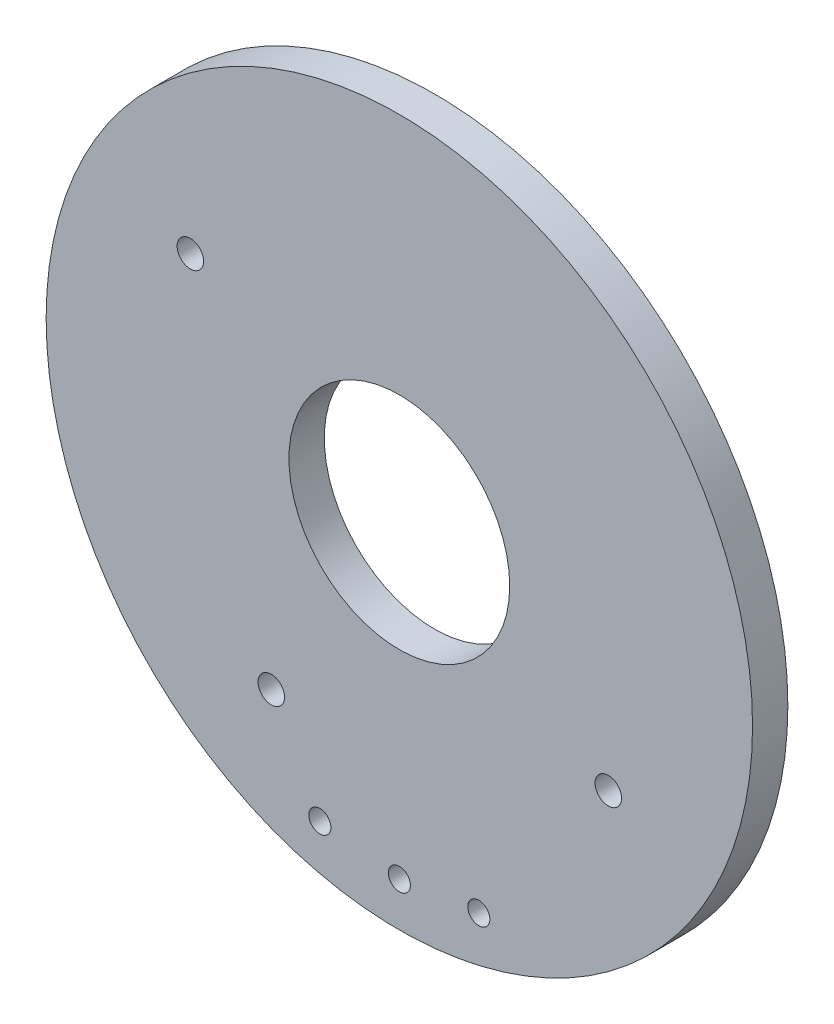
ISO-10303-21;
HEADER;
FILE_DESCRIPTION(('STEP AP214'),'2;1');
FILE_NAME('part.step','',(''),(''),'','','');
FILE_SCHEMA(('AUTOMOTIVE_DESIGN { 1 0 10303 214 1 1 1 1 }'));
ENDSEC;
DATA;
#1=APPLICATION_CONTEXT('core data for automotive mechanical design processes');
#2=APPLICATION_PROTOCOL_DEFINITION('international standard','automotive_design',2000,#1);
#3=PRODUCT_CONTEXT('',#1,'mechanical');
#4=PRODUCT('Part','Part','',(#3));
#5=PRODUCT_RELATED_PRODUCT_CATEGORY('part','',(#4));
#6=PRODUCT_DEFINITION_FORMATION('','',#4);
#7=PRODUCT_DEFINITION_CONTEXT('part definition',#1,'design');
#8=PRODUCT_DEFINITION('design','',#6,#7);
#9=PRODUCT_DEFINITION_SHAPE('','',#8);
#10=(LENGTH_UNIT() NAMED_UNIT(*) SI_UNIT(.MILLI.,.METRE.));
#11=(NAMED_UNIT(*) PLANE_ANGLE_UNIT() SI_UNIT($,.RADIAN.));
#12=(NAMED_UNIT(*) SI_UNIT($,.STERADIAN.) SOLID_ANGLE_UNIT());
#13=UNCERTAINTY_MEASURE_WITH_UNIT(LENGTH_MEASURE(1.E-05),#10,'distance_accuracy_value','');
#14=(GEOMETRIC_REPRESENTATION_CONTEXT(3) GLOBAL_UNCERTAINTY_ASSIGNED_CONTEXT((#13)) GLOBAL_UNIT_ASSIGNED_CONTEXT((#10,
#11,#12)) REPRESENTATION_CONTEXT('',''));
#15=CARTESIAN_POINT('',(0.,0.,0.));
#16=DIRECTION('',(0.,0.,1.));
#17=DIRECTION('',(1.,0.,0.));
#18=AXIS2_PLACEMENT_3D('',#15,#16,#17);
#19=CARTESIAN_POINT('',(0.,0.,0.8));
#20=DIRECTION('',(0.,0.,1.));
#21=DIRECTION('',(1.,0.,0.));
#22=AXIS2_PLACEMENT_3D('',#19,#20,#21);
#23=PLANE('',#22);
#24=CARTESIAN_POINT('',(-4.73299587998975,2.90000000000016,0.8));
#25=DIRECTION('',(0.,0.,1.));
#26=DIRECTION('',(1.,0.,0.));
#27=AXIS2_PLACEMENT_3D('',#24,#25,#26);
#28=CIRCLE('',#27,0.299999999999909);
#29=CARTESIAN_POINT('',(-4.43299587998985,2.90000000000016,0.8));
#30=VERTEX_POINT('',#29);
#31=EDGE_CURVE('E81',#30,#30,#28,.T.);
#32=ORIENTED_EDGE('',*,*,#31,.F.);
#33=EDGE_LOOP('',(#32));
#34=FACE_BOUND('',#33,.T.);
#35=CARTESIAN_POINT('',(-2.90000000000016,-4.73299587998975,0.8));
#36=DIRECTION('',(0.,0.,1.));
#37=DIRECTION('',(1.,0.,0.));
#38=AXIS2_PLACEMENT_3D('',#35,#36,#37);
#39=CIRCLE('',#38,0.300000000000102);
#40=CARTESIAN_POINT('',(-2.60000000000005,-4.73299587998975,0.8));
#41=VERTEX_POINT('',#40);
#42=EDGE_CURVE('E84',#41,#41,#39,.T.);
#43=ORIENTED_EDGE('',*,*,#42,.F.);
#44=EDGE_LOOP('',(#43));
#45=FACE_BOUND('',#44,.T.);
#46=CARTESIAN_POINT('',(4.73299587998975,-2.90000000000016,0.8));
#47=DIRECTION('',(0.,0.,1.));
#48=DIRECTION('',(1.,0.,0.));
#49=AXIS2_PLACEMENT_3D('',#46,#47,#48);
#50=CIRCLE('',#49,0.3);
#51=CARTESIAN_POINT('',(5.03299587998975,-2.90000000000016,0.8));
#52=VERTEX_POINT('',#51);
#53=EDGE_CURVE('E87',#52,#52,#50,.T.);
#54=ORIENTED_EDGE('',*,*,#53,.F.);
#55=EDGE_LOOP('',(#54));
#56=FACE_BOUND('',#55,.T.);
#57=CARTESIAN_POINT('',(1.8,-6.76461381011511,0.8));
#58=DIRECTION('',(0.,0.,1.));
#59=DIRECTION('',(1.,0.,0.));
#60=AXIS2_PLACEMENT_3D('',#57,#58,#59);
#61=CIRCLE('',#60,0.25);
#62=CARTESIAN_POINT('',(2.05,-6.76461381011511,0.8));
#63=VERTEX_POINT('',#62);
#64=EDGE_CURVE('E90',#63,#63,#61,.T.);
#65=ORIENTED_EDGE('',*,*,#64,.F.);
#66=EDGE_LOOP('',(#65));
#67=FACE_BOUND('',#66,.T.);
#68=CARTESIAN_POINT('',(-1.8,-6.76461381011511,0.8));
#69=DIRECTION('',(0.,0.,1.));
#70=DIRECTION('',(1.,0.,0.));
#71=AXIS2_PLACEMENT_3D('',#68,#69,#70);
#72=CIRCLE('',#71,0.25);
#73=CARTESIAN_POINT('',(-1.55,-6.76461381011511,0.8));
#74=VERTEX_POINT('',#73);
#75=EDGE_CURVE('E80',#74,#74,#72,.T.);
#76=ORIENTED_EDGE('',*,*,#75,.F.);
#77=EDGE_LOOP('',(#76));
#78=FACE_BOUND('',#77,.T.);
#79=CARTESIAN_POINT('',(0.,-7.,0.8));
#80=DIRECTION('',(0.,0.,1.));
#81=DIRECTION('',(1.,0.,0.));
#82=AXIS2_PLACEMENT_3D('',#79,#80,#81);
#83=CIRCLE('',#82,0.25);
#84=CARTESIAN_POINT('',(0.25,-7.,0.8));
#85=VERTEX_POINT('',#84);
#86=EDGE_CURVE('E56',#85,#85,#83,.T.);
#87=ORIENTED_EDGE('',*,*,#86,.F.);
#88=EDGE_LOOP('',(#87));
#89=FACE_BOUND('',#88,.T.);
#90=CARTESIAN_POINT('',(0.,0.,0.8));
#91=DIRECTION('',(0.,0.,1.));
#92=DIRECTION('',(1.,0.,0.));
#93=AXIS2_PLACEMENT_3D('',#90,#91,#92);
#94=CIRCLE('',#93,8.);
#95=CARTESIAN_POINT('',(8.,0.,0.8));
#96=VERTEX_POINT('',#95);
#97=EDGE_CURVE('E10',#96,#96,#94,.T.);
#98=ORIENTED_EDGE('',*,*,#97,.T.);
#99=EDGE_LOOP('',(#98));
#100=FACE_BOUND('',#99,.T.);
#101=CARTESIAN_POINT('',(0.,0.,0.8));
#102=DIRECTION('',(0.,0.,1.));
#103=DIRECTION('',(1.,0.,0.));
#104=AXIS2_PLACEMENT_3D('',#101,#102,#103);
#105=CIRCLE('',#104,2.5);
#106=CARTESIAN_POINT('',(2.5,0.,0.8));
#107=VERTEX_POINT('',#106);
#108=EDGE_CURVE('E46',#107,#107,#105,.T.);
#109=ORIENTED_EDGE('',*,*,#108,.F.);
#110=EDGE_LOOP('',(#109));
#111=FACE_BOUND('',#110,.T.);
#112=ADVANCED_FACE('F33',(#34,#45,#56,#67,#78,#89,#100,#111),#23,.T.);
#113=CARTESIAN_POINT('',(0.,0.,0.));
#114=DIRECTION('',(0.,0.,1.));
#115=DIRECTION('',(1.,0.,0.));
#116=AXIS2_PLACEMENT_3D('',#113,#114,#115);
#117=PLANE('',#116);
#118=CARTESIAN_POINT('',(-4.73299587998975,2.90000000000016,0.));
#119=DIRECTION('',(0.,0.,1.));
#120=DIRECTION('',(1.,0.,0.));
#121=AXIS2_PLACEMENT_3D('',#118,#119,#120);
#122=CIRCLE('',#121,0.299999999999909);
#123=CARTESIAN_POINT('',(-4.43299587998985,2.90000000000016,0.));
#124=VERTEX_POINT('',#123);
#125=EDGE_CURVE('E37',#124,#124,#122,.T.);
#126=ORIENTED_EDGE('',*,*,#125,.T.);
#127=EDGE_LOOP('',(#126));
#128=FACE_BOUND('',#127,.T.);
#129=CARTESIAN_POINT('',(-2.90000000000016,-4.73299587998975,0.));
#130=DIRECTION('',(0.,0.,1.));
#131=DIRECTION('',(1.,0.,0.));
#132=AXIS2_PLACEMENT_3D('',#129,#130,#131);
#133=CIRCLE('',#132,0.300000000000102);
#134=CARTESIAN_POINT('',(-2.60000000000005,-4.73299587998975,0.));
#135=VERTEX_POINT('',#134);
#136=EDGE_CURVE('E64',#135,#135,#133,.T.);
#137=ORIENTED_EDGE('',*,*,#136,.T.);
#138=EDGE_LOOP('',(#137));
#139=FACE_BOUND('',#138,.T.);
#140=CARTESIAN_POINT('',(4.73299587998975,-2.90000000000016,0.));
#141=DIRECTION('',(0.,0.,1.));
#142=DIRECTION('',(1.,0.,0.));
#143=AXIS2_PLACEMENT_3D('',#140,#141,#142);
#144=CIRCLE('',#143,0.3);
#145=CARTESIAN_POINT('',(5.03299587998975,-2.90000000000016,0.));
#146=VERTEX_POINT('',#145);
#147=EDGE_CURVE('E62',#146,#146,#144,.T.);
#148=ORIENTED_EDGE('',*,*,#147,.T.);
#149=EDGE_LOOP('',(#148));
#150=FACE_BOUND('',#149,.T.);
#151=CARTESIAN_POINT('',(1.8,-6.76461381011511,0.));
#152=DIRECTION('',(0.,0.,1.));
#153=DIRECTION('',(1.,0.,0.));
#154=AXIS2_PLACEMENT_3D('',#151,#152,#153);
#155=CIRCLE('',#154,0.25);
#156=CARTESIAN_POINT('',(2.05,-6.76461381011511,0.));
#157=VERTEX_POINT('',#156);
#158=EDGE_CURVE('E59',#157,#157,#155,.T.);
#159=ORIENTED_EDGE('',*,*,#158,.T.);
#160=EDGE_LOOP('',(#159));
#161=FACE_BOUND('',#160,.T.);
#162=CARTESIAN_POINT('',(-1.8,-6.76461381011511,0.));
#163=DIRECTION('',(0.,0.,1.));
#164=DIRECTION('',(1.,0.,0.));
#165=AXIS2_PLACEMENT_3D('',#162,#163,#164);
#166=CIRCLE('',#165,0.25);
#167=CARTESIAN_POINT('',(-1.55,-6.76461381011511,0.));
#168=VERTEX_POINT('',#167);
#169=EDGE_CURVE('E55',#168,#168,#166,.T.);
#170=ORIENTED_EDGE('',*,*,#169,.T.);
#171=EDGE_LOOP('',(#170));
#172=FACE_BOUND('',#171,.T.);
#173=CARTESIAN_POINT('',(0.,-7.,0.));
#174=DIRECTION('',(0.,0.,1.));
#175=DIRECTION('',(1.,0.,0.));
#176=AXIS2_PLACEMENT_3D('',#173,#174,#175);
#177=CIRCLE('',#176,0.25);
#178=CARTESIAN_POINT('',(0.25,-7.,0.));
#179=VERTEX_POINT('',#178);
#180=EDGE_CURVE('E52',#179,#179,#177,.T.);
#181=ORIENTED_EDGE('',*,*,#180,.T.);
#182=EDGE_LOOP('',(#181));
#183=FACE_BOUND('',#182,.T.);
#184=CARTESIAN_POINT('',(0.,0.,0.));
#185=DIRECTION('',(0.,0.,1.));
#186=DIRECTION('',(1.,0.,0.));
#187=AXIS2_PLACEMENT_3D('',#184,#185,#186);
#188=CIRCLE('',#187,8.);
#189=CARTESIAN_POINT('',(8.,0.,0.));
#190=VERTEX_POINT('',#189);
#191=EDGE_CURVE('E41',#190,#190,#188,.T.);
#192=ORIENTED_EDGE('',*,*,#191,.F.);
#193=EDGE_LOOP('',(#192));
#194=FACE_BOUND('',#193,.T.);
#195=CARTESIAN_POINT('',(0.,0.,0.));
#196=DIRECTION('',(0.,0.,1.));
#197=DIRECTION('',(1.,0.,0.));
#198=AXIS2_PLACEMENT_3D('',#195,#196,#197);
#199=CIRCLE('',#198,2.5);
#200=CARTESIAN_POINT('',(2.5,0.,0.));
#201=VERTEX_POINT('',#200);
#202=EDGE_CURVE('E49',#201,#201,#199,.T.);
#203=ORIENTED_EDGE('',*,*,#202,.T.);
#204=EDGE_LOOP('',(#203));
#205=FACE_BOUND('',#204,.T.);
#206=ADVANCED_FACE('F101',(#128,#139,#150,#161,#172,#183,#194,#205),#117,.F.);
#207=CARTESIAN_POINT('',(0.,0.,0.8));
#208=DIRECTION('',(0.,0.,-1.));
#209=DIRECTION('',(-1.,0.,0.));
#210=AXIS2_PLACEMENT_3D('',#207,#208,#209);
#211=CYLINDRICAL_SURFACE('',#210,8.);
#212=ORIENTED_EDGE('',*,*,#97,.F.);
#213=EDGE_LOOP('',(#212));
#214=FACE_BOUND('',#213,.T.);
#215=ORIENTED_EDGE('',*,*,#191,.T.);
#216=EDGE_LOOP('',(#215));
#217=FACE_BOUND('',#216,.T.);
#218=ADVANCED_FACE('F35',(#214,#217),#211,.T.);
#219=CARTESIAN_POINT('',(0.,0.,0.8));
#220=DIRECTION('',(0.,0.,-1.));
#221=DIRECTION('',(-1.,0.,0.));
#222=AXIS2_PLACEMENT_3D('',#219,#220,#221);
#223=CYLINDRICAL_SURFACE('',#222,2.5);
#224=ORIENTED_EDGE('',*,*,#108,.T.);
#225=EDGE_LOOP('',(#224));
#226=FACE_BOUND('',#225,.T.);
#227=ORIENTED_EDGE('',*,*,#202,.F.);
#228=EDGE_LOOP('',(#227));
#229=FACE_BOUND('',#228,.T.);
#230=ADVANCED_FACE('F110',(#226,#229),#223,.F.);
#231=CARTESIAN_POINT('',(0.,-7.,-0.8));
#232=DIRECTION('',(0.,0.,1.));
#233=DIRECTION('',(1.,0.,0.));
#234=AXIS2_PLACEMENT_3D('',#231,#232,#233);
#235=CYLINDRICAL_SURFACE('',#234,0.25);
#236=ORIENTED_EDGE('',*,*,#86,.T.);
#237=EDGE_LOOP('',(#236));
#238=FACE_BOUND('',#237,.T.);
#239=ORIENTED_EDGE('',*,*,#180,.F.);
#240=EDGE_LOOP('',(#239));
#241=FACE_BOUND('',#240,.T.);
#242=ADVANCED_FACE('F107',(#238,#241),#235,.F.);
#243=CARTESIAN_POINT('',(-1.8,-6.76461381011511,-0.8));
#244=DIRECTION('',(0.,0.,1.));
#245=DIRECTION('',(1.,0.,0.));
#246=AXIS2_PLACEMENT_3D('',#243,#244,#245);
#247=CYLINDRICAL_SURFACE('',#246,0.25);
#248=ORIENTED_EDGE('',*,*,#75,.T.);
#249=EDGE_LOOP('',(#248));
#250=FACE_BOUND('',#249,.T.);
#251=ORIENTED_EDGE('',*,*,#169,.F.);
#252=EDGE_LOOP('',(#251));
#253=FACE_BOUND('',#252,.T.);
#254=ADVANCED_FACE('F96',(#250,#253),#247,.F.);
#255=CARTESIAN_POINT('',(1.8,-6.76461381011511,-0.8));
#256=DIRECTION('',(0.,0.,1.));
#257=DIRECTION('',(1.,0.,0.));
#258=AXIS2_PLACEMENT_3D('',#255,#256,#257);
#259=CYLINDRICAL_SURFACE('',#258,0.25);
#260=ORIENTED_EDGE('',*,*,#64,.T.);
#261=EDGE_LOOP('',(#260));
#262=FACE_BOUND('',#261,.T.);
#263=ORIENTED_EDGE('',*,*,#158,.F.);
#264=EDGE_LOOP('',(#263));
#265=FACE_BOUND('',#264,.T.);
#266=ADVANCED_FACE('F139',(#262,#265),#259,.F.);
#267=CARTESIAN_POINT('',(4.73299587998975,-2.90000000000016,-0.8));
#268=DIRECTION('',(0.,0.,1.));
#269=DIRECTION('',(1.,0.,0.));
#270=AXIS2_PLACEMENT_3D('',#267,#268,#269);
#271=CYLINDRICAL_SURFACE('',#270,0.3);
#272=ORIENTED_EDGE('',*,*,#53,.T.);
#273=EDGE_LOOP('',(#272));
#274=FACE_BOUND('',#273,.T.);
#275=ORIENTED_EDGE('',*,*,#147,.F.);
#276=EDGE_LOOP('',(#275));
#277=FACE_BOUND('',#276,.T.);
#278=ADVANCED_FACE('F135',(#274,#277),#271,.F.);
#279=CARTESIAN_POINT('',(-2.90000000000016,-4.73299587998975,-0.8));
#280=DIRECTION('',(0.,0.,1.));
#281=DIRECTION('',(1.,0.,0.));
#282=AXIS2_PLACEMENT_3D('',#279,#280,#281);
#283=CYLINDRICAL_SURFACE('',#282,0.300000000000102);
#284=ORIENTED_EDGE('',*,*,#42,.T.);
#285=EDGE_LOOP('',(#284));
#286=FACE_BOUND('',#285,.T.);
#287=ORIENTED_EDGE('',*,*,#136,.F.);
#288=EDGE_LOOP('',(#287));
#289=FACE_BOUND('',#288,.T.);
#290=ADVANCED_FACE('F131',(#286,#289),#283,.F.);
#291=CARTESIAN_POINT('',(-4.73299587998975,2.90000000000016,-0.8));
#292=DIRECTION('',(0.,0.,1.));
#293=DIRECTION('',(1.,0.,0.));
#294=AXIS2_PLACEMENT_3D('',#291,#292,#293);
#295=CYLINDRICAL_SURFACE('',#294,0.299999999999909);
#296=ORIENTED_EDGE('',*,*,#31,.T.);
#297=EDGE_LOOP('',(#296));
#298=FACE_BOUND('',#297,.T.);
#299=ORIENTED_EDGE('',*,*,#125,.F.);
#300=EDGE_LOOP('',(#299));
#301=FACE_BOUND('',#300,.T.);
#302=ADVANCED_FACE('F128',(#298,#301),#295,.F.);
#303=CLOSED_SHELL('',(#112,#206,#218,#230,#242,#254,#266,#278,#290,#302));
#304=MANIFOLD_SOLID_BREP('B2',#303);
#305=ADVANCED_BREP_SHAPE_REPRESENTATION('',(#18,#304),#14);
#306=SHAPE_DEFINITION_REPRESENTATION(#9,#305);
ENDSEC;
END-ISO-10303-21;
